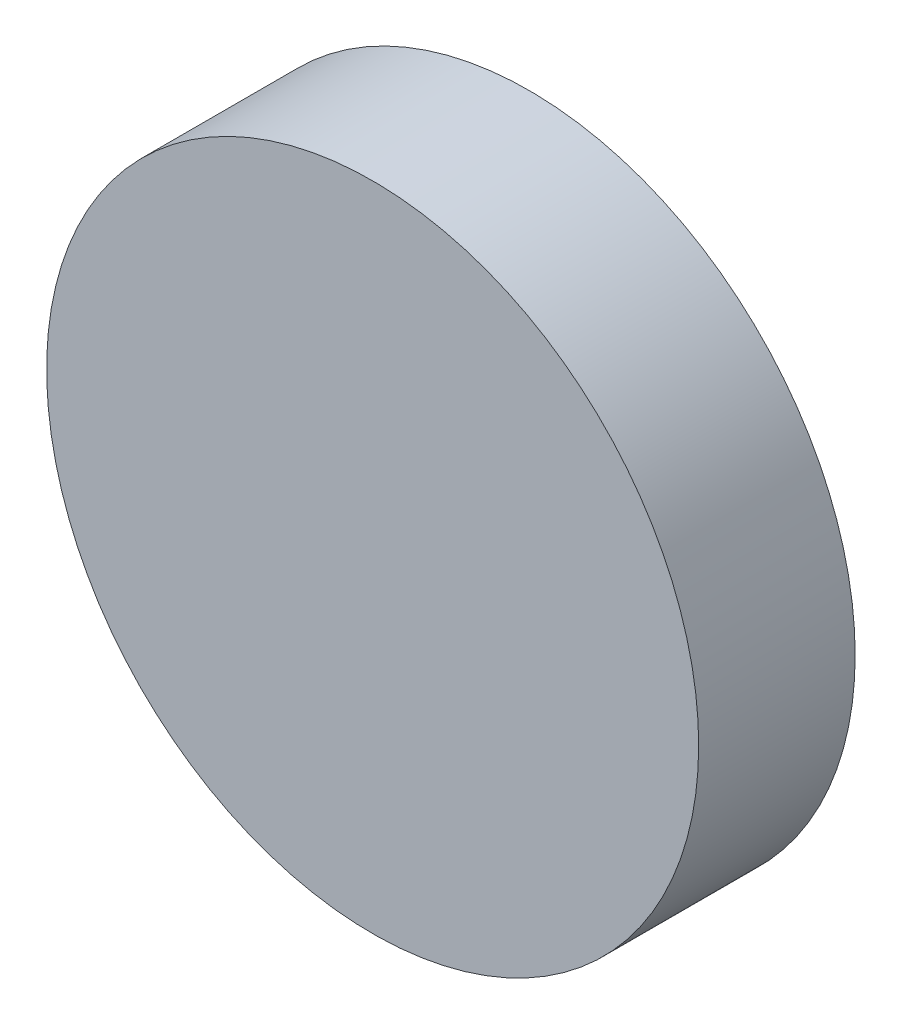
ISO-10303-21;
HEADER;
FILE_DESCRIPTION(('STEP AP214'),'2;1');
FILE_NAME('part.step','',(''),(''),'','','');
FILE_SCHEMA(('AUTOMOTIVE_DESIGN { 1 0 10303 214 1 1 1 1 }'));
ENDSEC;
DATA;
#1=APPLICATION_CONTEXT('core data for automotive mechanical design processes');
#2=APPLICATION_PROTOCOL_DEFINITION('international standard','automotive_design',2000,#1);
#3=PRODUCT_CONTEXT('',#1,'mechanical');
#4=PRODUCT('Part','Part','',(#3));
#5=PRODUCT_RELATED_PRODUCT_CATEGORY('part','',(#4));
#6=PRODUCT_DEFINITION_FORMATION('','',#4);
#7=PRODUCT_DEFINITION_CONTEXT('part definition',#1,'design');
#8=PRODUCT_DEFINITION('design','',#6,#7);
#9=PRODUCT_DEFINITION_SHAPE('','',#8);
#10=(LENGTH_UNIT() NAMED_UNIT(*) SI_UNIT(.MILLI.,.METRE.));
#11=(NAMED_UNIT(*) PLANE_ANGLE_UNIT() SI_UNIT($,.RADIAN.));
#12=(NAMED_UNIT(*) SI_UNIT($,.STERADIAN.) SOLID_ANGLE_UNIT());
#13=UNCERTAINTY_MEASURE_WITH_UNIT(LENGTH_MEASURE(1.E-05),#10,'distance_accuracy_value','');
#14=(GEOMETRIC_REPRESENTATION_CONTEXT(3) GLOBAL_UNCERTAINTY_ASSIGNED_CONTEXT((#13)) GLOBAL_UNIT_ASSIGNED_CONTEXT((#10,
#11,#12)) REPRESENTATION_CONTEXT('',''));
#15=CARTESIAN_POINT('',(0.,0.,0.));
#16=DIRECTION('',(0.,0.,1.));
#17=DIRECTION('',(1.,0.,0.));
#18=AXIS2_PLACEMENT_3D('',#15,#16,#17);
#19=CARTESIAN_POINT('',(0.,0.,3.));
#20=DIRECTION('',(0.,0.,-1.));
#21=DIRECTION('',(-1.,0.,0.));
#22=AXIS2_PLACEMENT_3D('',#19,#20,#21);
#23=CYLINDRICAL_SURFACE('',#22,6.25);
#24=CARTESIAN_POINT('',(0.,0.,3.));
#25=DIRECTION('',(0.,0.,1.));
#26=DIRECTION('',(1.,0.,0.));
#27=AXIS2_PLACEMENT_3D('',#24,#25,#26);
#28=CIRCLE('',#27,6.25);
#29=CARTESIAN_POINT('',(6.25,0.,3.));
#30=VERTEX_POINT('',#29);
#31=EDGE_CURVE('E10',#30,#30,#28,.T.);
#32=ORIENTED_EDGE('',*,*,#31,.F.);
#33=EDGE_LOOP('',(#32));
#34=FACE_BOUND('',#33,.T.);
#35=CARTESIAN_POINT('',(0.,0.,0.));
#36=DIRECTION('',(0.,0.,1.));
#37=DIRECTION('',(1.,0.,0.));
#38=AXIS2_PLACEMENT_3D('',#35,#36,#37);
#39=CIRCLE('',#38,6.25);
#40=CARTESIAN_POINT('',(6.25,0.,0.));
#41=VERTEX_POINT('',#40);
#42=EDGE_CURVE('E36',#41,#41,#39,.T.);
#43=ORIENTED_EDGE('',*,*,#42,.T.);
#44=EDGE_LOOP('',(#43));
#45=FACE_BOUND('',#44,.T.);
#46=ADVANCED_FACE('F33',(#34,#45),#23,.T.);
#47=CARTESIAN_POINT('',(0.,0.,3.));
#48=DIRECTION('',(0.,0.,1.));
#49=DIRECTION('',(1.,0.,0.));
#50=AXIS2_PLACEMENT_3D('',#47,#48,#49);
#51=PLANE('',#50);
#52=ORIENTED_EDGE('',*,*,#31,.T.);
#53=EDGE_LOOP('',(#52));
#54=FACE_BOUND('',#53,.T.);
#55=ADVANCED_FACE('F48',(#54),#51,.T.);
#56=CARTESIAN_POINT('',(0.,0.,0.));
#57=DIRECTION('',(0.,0.,1.));
#58=DIRECTION('',(1.,0.,0.));
#59=AXIS2_PLACEMENT_3D('',#56,#57,#58);
#60=PLANE('',#59);
#61=ORIENTED_EDGE('',*,*,#42,.F.);
#62=EDGE_LOOP('',(#61));
#63=FACE_BOUND('',#62,.T.);
#64=ADVANCED_FACE('F46',(#63),#60,.F.);
#65=CLOSED_SHELL('',(#46,#55,#64));
#66=MANIFOLD_SOLID_BREP('B2',#65);
#67=ADVANCED_BREP_SHAPE_REPRESENTATION('',(#18,#66),#14);
#68=SHAPE_DEFINITION_REPRESENTATION(#9,#67);
ENDSEC;
END-ISO-10303-21;
